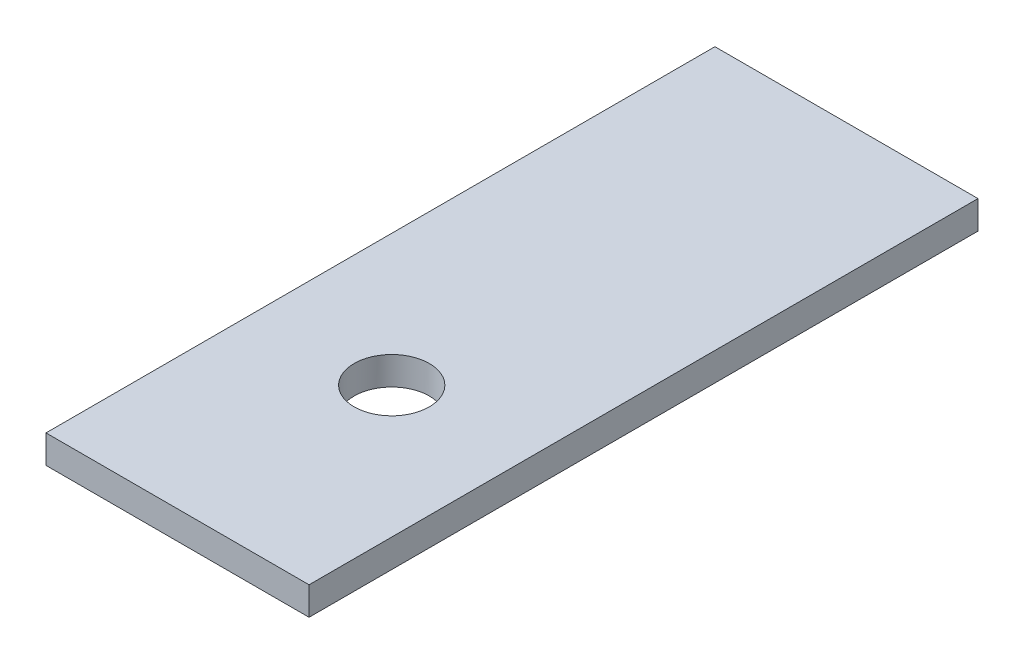
ISO-10303-21;
HEADER;
FILE_DESCRIPTION(('STEP AP214'),'2;1');
FILE_NAME('part.step','',(''),(''),'','','');
FILE_SCHEMA(('AUTOMOTIVE_DESIGN { 1 0 10303 214 1 1 1 1 }'));
ENDSEC;
DATA;
#1=APPLICATION_CONTEXT('core data for automotive mechanical design processes');
#2=APPLICATION_PROTOCOL_DEFINITION('international standard','automotive_design',2000,#1);
#3=PRODUCT_CONTEXT('',#1,'mechanical');
#4=PRODUCT('Part','Part','',(#3));
#5=PRODUCT_RELATED_PRODUCT_CATEGORY('part','',(#4));
#6=PRODUCT_DEFINITION_FORMATION('','',#4);
#7=PRODUCT_DEFINITION_CONTEXT('part definition',#1,'design');
#8=PRODUCT_DEFINITION('design','',#6,#7);
#9=PRODUCT_DEFINITION_SHAPE('','',#8);
#10=(LENGTH_UNIT() NAMED_UNIT(*) SI_UNIT(.MILLI.,.METRE.));
#11=(NAMED_UNIT(*) PLANE_ANGLE_UNIT() SI_UNIT($,.RADIAN.));
#12=(NAMED_UNIT(*) SI_UNIT($,.STERADIAN.) SOLID_ANGLE_UNIT());
#13=UNCERTAINTY_MEASURE_WITH_UNIT(LENGTH_MEASURE(1.E-05),#10,'distance_accuracy_value','');
#14=(GEOMETRIC_REPRESENTATION_CONTEXT(3) GLOBAL_UNCERTAINTY_ASSIGNED_CONTEXT((#13)) GLOBAL_UNIT_ASSIGNED_CONTEXT((#10,
#11,#12)) REPRESENTATION_CONTEXT('',''));
#15=CARTESIAN_POINT('',(0.,0.,0.));
#16=DIRECTION('',(0.,0.,1.));
#17=DIRECTION('',(1.,0.,0.));
#18=AXIS2_PLACEMENT_3D('',#15,#16,#17);
#19=CARTESIAN_POINT('',(14.,3.,35.6));
#20=DIRECTION('',(-1.,0.,0.));
#21=DIRECTION('',(0.,0.,1.));
#22=AXIS2_PLACEMENT_3D('',#19,#20,#21);
#23=PLANE('',#22);
#24=DIRECTION('',(0.,0.,-1.));
#25=VECTOR('',#24,1.);
#26=CARTESIAN_POINT('',(14.,0.,35.6));
#27=LINE('',#26,#25);
#28=CARTESIAN_POINT('',(14.,0.,35.6));
#29=VERTEX_POINT('',#28);
#30=CARTESIAN_POINT('',(14.,0.,-35.6));
#31=VERTEX_POINT('',#30);
#32=EDGE_CURVE('E102',#29,#31,#27,.T.);
#33=ORIENTED_EDGE('',*,*,#32,.T.);
#34=DIRECTION('',(0.,-1.,0.));
#35=VECTOR('',#34,1.);
#36=CARTESIAN_POINT('',(14.,3.,-35.6));
#37=LINE('',#36,#35);
#38=CARTESIAN_POINT('',(14.,3.,-35.6));
#39=VERTEX_POINT('',#38);
#40=EDGE_CURVE('E11',#39,#31,#37,.T.);
#41=ORIENTED_EDGE('',*,*,#40,.F.);
#42=DIRECTION('',(0.,0.,-1.));
#43=VECTOR('',#42,1.);
#44=CARTESIAN_POINT('',(14.,3.,35.6));
#45=LINE('',#44,#43);
#46=CARTESIAN_POINT('',(14.,3.,35.6));
#47=VERTEX_POINT('',#46);
#48=EDGE_CURVE('E89',#47,#39,#45,.T.);
#49=ORIENTED_EDGE('',*,*,#48,.F.);
#50=DIRECTION('',(0.,-1.,0.));
#51=VECTOR('',#50,1.);
#52=CARTESIAN_POINT('',(14.,3.,35.6));
#53=LINE('',#52,#51);
#54=EDGE_CURVE('E98',#47,#29,#53,.T.);
#55=ORIENTED_EDGE('',*,*,#54,.T.);
#56=EDGE_LOOP('',(#33,#41,#49,#55));
#57=FACE_BOUND('',#56,.T.);
#58=ADVANCED_FACE('F37',(#57),#23,.F.);
#59=CARTESIAN_POINT('',(-14.,3.,-35.6));
#60=DIRECTION('',(0.,0.,1.));
#61=DIRECTION('',(1.,0.,0.));
#62=AXIS2_PLACEMENT_3D('',#59,#60,#61);
#63=PLANE('',#62);
#64=DIRECTION('',(-1.,0.,0.));
#65=VECTOR('',#64,1.);
#66=CARTESIAN_POINT('',(-14.,0.,-35.6));
#67=LINE('',#66,#65);
#68=CARTESIAN_POINT('',(-14.,0.,-35.6));
#69=VERTEX_POINT('',#68);
#70=EDGE_CURVE('E93',#31,#69,#67,.T.);
#71=ORIENTED_EDGE('',*,*,#70,.T.);
#72=DIRECTION('',(0.,-1.,0.));
#73=VECTOR('',#72,1.);
#74=CARTESIAN_POINT('',(-14.,3.,-35.6));
#75=LINE('',#74,#73);
#76=CARTESIAN_POINT('',(-14.,3.,-35.6));
#77=VERTEX_POINT('',#76);
#78=EDGE_CURVE('E46',#77,#69,#75,.T.);
#79=ORIENTED_EDGE('',*,*,#78,.F.);
#80=DIRECTION('',(-1.,0.,0.));
#81=VECTOR('',#80,1.);
#82=CARTESIAN_POINT('',(-14.,3.,-35.6));
#83=LINE('',#82,#81);
#84=EDGE_CURVE('E84',#39,#77,#83,.T.);
#85=ORIENTED_EDGE('',*,*,#84,.F.);
#86=ORIENTED_EDGE('',*,*,#40,.T.);
#87=EDGE_LOOP('',(#71,#79,#85,#86));
#88=FACE_BOUND('',#87,.T.);
#89=ADVANCED_FACE('F92',(#88),#63,.F.);
#90=CARTESIAN_POINT('',(-14.,3.,35.6));
#91=DIRECTION('',(1.,0.,0.));
#92=DIRECTION('',(0.,0.,-1.));
#93=AXIS2_PLACEMENT_3D('',#90,#91,#92);
#94=PLANE('',#93);
#95=DIRECTION('',(0.,0.,1.));
#96=VECTOR('',#95,1.);
#97=CARTESIAN_POINT('',(-14.,0.,35.6));
#98=LINE('',#97,#96);
#99=CARTESIAN_POINT('',(-14.,0.,35.6));
#100=VERTEX_POINT('',#99);
#101=EDGE_CURVE('E71',#69,#100,#98,.T.);
#102=ORIENTED_EDGE('',*,*,#101,.T.);
#103=DIRECTION('',(0.,-1.,0.));
#104=VECTOR('',#103,1.);
#105=CARTESIAN_POINT('',(-14.,3.,35.6));
#106=LINE('',#105,#104);
#107=CARTESIAN_POINT('',(-14.,3.,35.6));
#108=VERTEX_POINT('',#107);
#109=EDGE_CURVE('E94',#108,#100,#106,.T.);
#110=ORIENTED_EDGE('',*,*,#109,.F.);
#111=DIRECTION('',(0.,0.,1.));
#112=VECTOR('',#111,1.);
#113=CARTESIAN_POINT('',(-14.,3.,35.6));
#114=LINE('',#113,#112);
#115=EDGE_CURVE('E87',#77,#108,#114,.T.);
#116=ORIENTED_EDGE('',*,*,#115,.F.);
#117=ORIENTED_EDGE('',*,*,#78,.T.);
#118=EDGE_LOOP('',(#102,#110,#116,#117));
#119=FACE_BOUND('',#118,.T.);
#120=ADVANCED_FACE('F96',(#119),#94,.F.);
#121=CARTESIAN_POINT('',(-14.,3.,35.6));
#122=DIRECTION('',(0.,0.,-1.));
#123=DIRECTION('',(-1.,0.,0.));
#124=AXIS2_PLACEMENT_3D('',#121,#122,#123);
#125=PLANE('',#124);
#126=DIRECTION('',(1.,0.,0.));
#127=VECTOR('',#126,1.);
#128=CARTESIAN_POINT('',(-14.,0.,35.6));
#129=LINE('',#128,#127);
#130=EDGE_CURVE('E77',#100,#29,#129,.T.);
#131=ORIENTED_EDGE('',*,*,#130,.T.);
#132=ORIENTED_EDGE('',*,*,#54,.F.);
#133=DIRECTION('',(1.,0.,0.));
#134=VECTOR('',#133,1.);
#135=CARTESIAN_POINT('',(-14.,3.,35.6));
#136=LINE('',#135,#134);
#137=EDGE_CURVE('E54',#108,#47,#136,.T.);
#138=ORIENTED_EDGE('',*,*,#137,.F.);
#139=ORIENTED_EDGE('',*,*,#109,.T.);
#140=EDGE_LOOP('',(#131,#132,#138,#139));
#141=FACE_BOUND('',#140,.T.);
#142=ADVANCED_FACE('F109',(#141),#125,.F.);
#143=CARTESIAN_POINT('',(0.,3.,0.));
#144=DIRECTION('',(0.,-1.,0.));
#145=DIRECTION('',(0.,0.,-1.));
#146=AXIS2_PLACEMENT_3D('',#143,#144,#145);
#147=PLANE('',#146);
#148=CARTESIAN_POINT('',(0.,3.,12.7999999999985));
#149=DIRECTION('',(0.,1.,0.));
#150=DIRECTION('',(0.,0.,1.));
#151=AXIS2_PLACEMENT_3D('',#148,#149,#150);
#152=CIRCLE('',#151,4.);
#153=CARTESIAN_POINT('',(0.,3.,16.7999999999985));
#154=VERTEX_POINT('',#153);
#155=EDGE_CURVE('E115',#154,#154,#152,.T.);
#156=ORIENTED_EDGE('',*,*,#155,.F.);
#157=EDGE_LOOP('',(#156));
#158=FACE_BOUND('',#157,.T.);
#159=ORIENTED_EDGE('',*,*,#48,.T.);
#160=ORIENTED_EDGE('',*,*,#84,.T.);
#161=ORIENTED_EDGE('',*,*,#115,.T.);
#162=ORIENTED_EDGE('',*,*,#137,.T.);
#163=EDGE_LOOP('',(#159,#160,#161,#162));
#164=FACE_BOUND('',#163,.T.);
#165=ADVANCED_FACE('F85',(#158,#164),#147,.F.);
#166=CARTESIAN_POINT('',(0.,0.,0.));
#167=DIRECTION('',(0.,-1.,0.));
#168=DIRECTION('',(0.,0.,-1.));
#169=AXIS2_PLACEMENT_3D('',#166,#167,#168);
#170=PLANE('',#169);
#171=CARTESIAN_POINT('',(0.,0.,12.7999999999985));
#172=DIRECTION('',(0.,-1.,0.));
#173=DIRECTION('',(0.,0.,-1.));
#174=AXIS2_PLACEMENT_3D('',#171,#172,#173);
#175=CIRCLE('',#174,4.);
#176=CARTESIAN_POINT('',(0.,0.,8.79999999999852));
#177=VERTEX_POINT('',#176);
#178=EDGE_CURVE('E40',#177,#177,#175,.T.);
#179=ORIENTED_EDGE('',*,*,#178,.F.);
#180=EDGE_LOOP('',(#179));
#181=FACE_BOUND('',#180,.T.);
#182=ORIENTED_EDGE('',*,*,#32,.F.);
#183=ORIENTED_EDGE('',*,*,#130,.F.);
#184=ORIENTED_EDGE('',*,*,#101,.F.);
#185=ORIENTED_EDGE('',*,*,#70,.F.);
#186=EDGE_LOOP('',(#182,#183,#184,#185));
#187=FACE_BOUND('',#186,.T.);
#188=ADVANCED_FACE('F112',(#181,#187),#170,.T.);
#189=CARTESIAN_POINT('',(0.,-7.,12.7999999999985));
#190=DIRECTION('',(0.,1.,0.));
#191=DIRECTION('',(0.,0.,1.));
#192=AXIS2_PLACEMENT_3D('',#189,#190,#191);
#193=CYLINDRICAL_SURFACE('',#192,4.);
#194=ORIENTED_EDGE('',*,*,#178,.T.);
#195=EDGE_LOOP('',(#194));
#196=FACE_BOUND('',#195,.T.);
#197=ORIENTED_EDGE('',*,*,#155,.T.);
#198=EDGE_LOOP('',(#197));
#199=FACE_BOUND('',#198,.T.);
#200=ADVANCED_FACE('F122',(#196,#199),#193,.F.);
#201=CLOSED_SHELL('',(#58,#89,#120,#142,#165,#188,#200));
#202=MANIFOLD_SOLID_BREP('B2',#201);
#203=ADVANCED_BREP_SHAPE_REPRESENTATION('',(#18,#202),#14);
#204=SHAPE_DEFINITION_REPRESENTATION(#9,#203);
ENDSEC;
END-ISO-10303-21;
